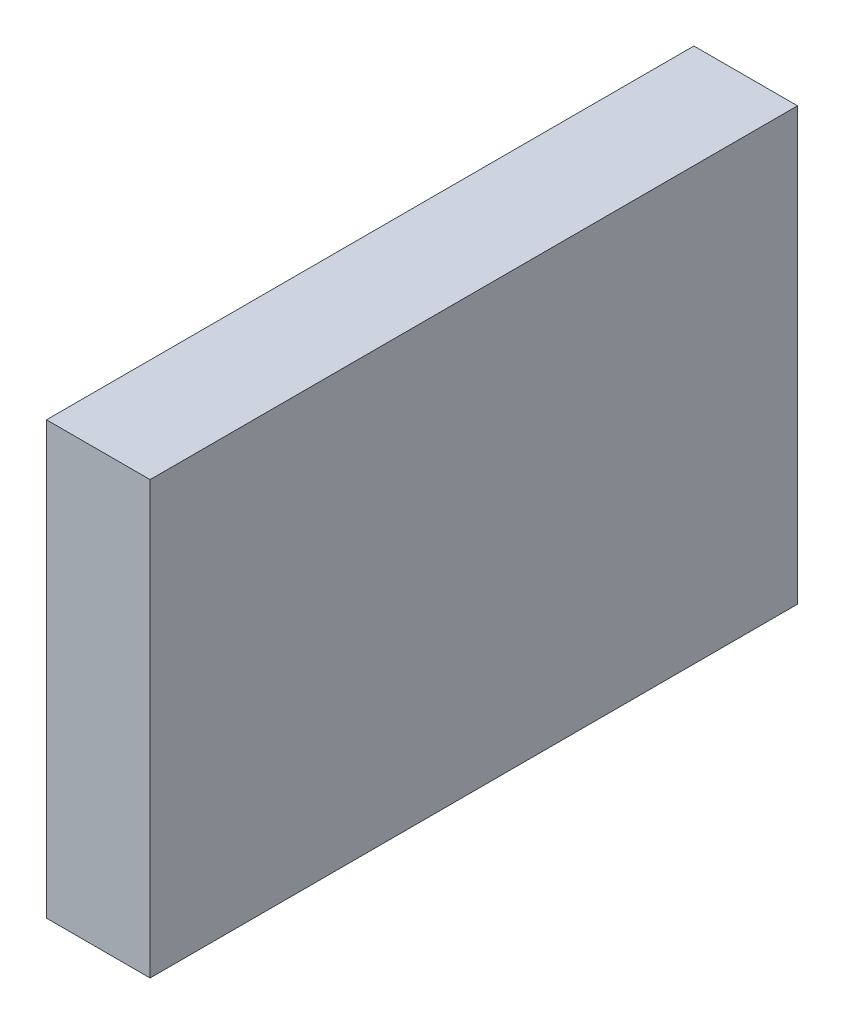
ISO-10303-21;
HEADER;
FILE_DESCRIPTION(('STEP AP214'),'2;1');
FILE_NAME('part.step','',(''),(''),'','','');
FILE_SCHEMA(('AUTOMOTIVE_DESIGN { 1 0 10303 214 1 1 1 1 }'));
ENDSEC;
DATA;
#1=APPLICATION_CONTEXT('core data for automotive mechanical design processes');
#2=APPLICATION_PROTOCOL_DEFINITION('international standard','automotive_design',2000,#1);
#3=PRODUCT_CONTEXT('',#1,'mechanical');
#4=PRODUCT('Part','Part','',(#3));
#5=PRODUCT_RELATED_PRODUCT_CATEGORY('part','',(#4));
#6=PRODUCT_DEFINITION_FORMATION('','',#4);
#7=PRODUCT_DEFINITION_CONTEXT('part definition',#1,'design');
#8=PRODUCT_DEFINITION('design','',#6,#7);
#9=PRODUCT_DEFINITION_SHAPE('','',#8);
#10=(LENGTH_UNIT() NAMED_UNIT(*) SI_UNIT(.MILLI.,.METRE.));
#11=(NAMED_UNIT(*) PLANE_ANGLE_UNIT() SI_UNIT($,.RADIAN.));
#12=(NAMED_UNIT(*) SI_UNIT($,.STERADIAN.) SOLID_ANGLE_UNIT());
#13=UNCERTAINTY_MEASURE_WITH_UNIT(LENGTH_MEASURE(1.E-05),#10,'distance_accuracy_value','');
#14=(GEOMETRIC_REPRESENTATION_CONTEXT(3) GLOBAL_UNCERTAINTY_ASSIGNED_CONTEXT((#13)) GLOBAL_UNIT_ASSIGNED_CONTEXT((#10,
#11,#12)) REPRESENTATION_CONTEXT('',''));
#15=CARTESIAN_POINT('',(0.,0.,0.));
#16=DIRECTION('',(0.,0.,1.));
#17=DIRECTION('',(1.,0.,0.));
#18=AXIS2_PLACEMENT_3D('',#15,#16,#17);
#19=CARTESIAN_POINT('',(12.7,25.4,38.1));
#20=DIRECTION('',(0.,0.,-1.));
#21=DIRECTION('',(-1.,0.,0.));
#22=AXIS2_PLACEMENT_3D('',#19,#20,#21);
#23=PLANE('',#22);
#24=DIRECTION('',(-1.,0.,0.));
#25=VECTOR('',#24,1.);
#26=CARTESIAN_POINT('',(12.7,25.4,38.1));
#27=LINE('',#26,#25);
#28=CARTESIAN_POINT('',(12.7,25.4,38.1));
#29=VERTEX_POINT('',#28);
#30=CARTESIAN_POINT('',(0.507999999999995,25.4,38.1));
#31=VERTEX_POINT('',#30);
#32=EDGE_CURVE('E152',#29,#31,#27,.T.);
#33=ORIENTED_EDGE('',*,*,#32,.T.);
#34=DIRECTION('',(0.,-1.,0.));
#35=VECTOR('',#34,1.);
#36=CARTESIAN_POINT('',(0.507999999999995,25.4,38.1));
#37=LINE('',#36,#35);
#38=CARTESIAN_POINT('',(0.507999999999995,-25.4,38.1));
#39=VERTEX_POINT('',#38);
#40=EDGE_CURVE('E11',#31,#39,#37,.T.);
#41=ORIENTED_EDGE('',*,*,#40,.T.);
#42=DIRECTION('',(-1.,0.,0.));
#43=VECTOR('',#42,1.);
#44=CARTESIAN_POINT('',(12.7,-25.4,38.1));
#45=LINE('',#44,#43);
#46=CARTESIAN_POINT('',(12.7,-25.4,38.1));
#47=VERTEX_POINT('',#46);
#48=EDGE_CURVE('E94',#47,#39,#45,.T.);
#49=ORIENTED_EDGE('',*,*,#48,.F.);
#50=DIRECTION('',(0.,-1.,0.));
#51=VECTOR('',#50,1.);
#52=CARTESIAN_POINT('',(12.7,25.4,38.1));
#53=LINE('',#52,#51);
#54=EDGE_CURVE('E100',#29,#47,#53,.T.);
#55=ORIENTED_EDGE('',*,*,#54,.F.);
#56=EDGE_LOOP('',(#33,#41,#49,#55));
#57=FACE_BOUND('',#56,.T.);
#58=ADVANCED_FACE('F33',(#57),#23,.F.);
#59=CARTESIAN_POINT('',(12.7,-25.4,38.1));
#60=DIRECTION('',(0.,1.,0.));
#61=DIRECTION('',(0.,0.,1.));
#62=AXIS2_PLACEMENT_3D('',#59,#60,#61);
#63=PLANE('',#62);
#64=ORIENTED_EDGE('',*,*,#48,.T.);
#65=DIRECTION('',(0.,0.,-1.));
#66=VECTOR('',#65,1.);
#67=CARTESIAN_POINT('',(0.507999999999995,-25.4,38.1));
#68=LINE('',#67,#66);
#69=CARTESIAN_POINT('',(0.507999999999995,-25.4,-38.1));
#70=VERTEX_POINT('',#69);
#71=EDGE_CURVE('E109',#39,#70,#68,.T.);
#72=ORIENTED_EDGE('',*,*,#71,.T.);
#73=DIRECTION('',(-1.,0.,0.));
#74=VECTOR('',#73,1.);
#75=CARTESIAN_POINT('',(12.7,-25.4,-38.1));
#76=LINE('',#75,#74);
#77=CARTESIAN_POINT('',(12.7,-25.4,-38.1));
#78=VERTEX_POINT('',#77);
#79=EDGE_CURVE('E96',#78,#70,#76,.T.);
#80=ORIENTED_EDGE('',*,*,#79,.F.);
#81=DIRECTION('',(0.,0.,-1.));
#82=VECTOR('',#81,1.);
#83=CARTESIAN_POINT('',(12.7,-25.4,38.1));
#84=LINE('',#83,#82);
#85=EDGE_CURVE('E89',#47,#78,#84,.T.);
#86=ORIENTED_EDGE('',*,*,#85,.F.);
#87=EDGE_LOOP('',(#64,#72,#80,#86));
#88=FACE_BOUND('',#87,.T.);
#89=ADVANCED_FACE('F91',(#88),#63,.F.);
#90=CARTESIAN_POINT('',(12.7,25.4,-38.1));
#91=DIRECTION('',(0.,0.,1.));
#92=DIRECTION('',(0.,-1.,0.));
#93=AXIS2_PLACEMENT_3D('',#90,#91,#92);
#94=PLANE('',#93);
#95=ORIENTED_EDGE('',*,*,#79,.T.);
#96=DIRECTION('',(0.,1.,0.));
#97=VECTOR('',#96,1.);
#98=CARTESIAN_POINT('',(0.507999999999995,25.4,-38.1));
#99=LINE('',#98,#97);
#100=CARTESIAN_POINT('',(0.507999999999995,25.4,-38.1));
#101=VERTEX_POINT('',#100);
#102=EDGE_CURVE('E57',#70,#101,#99,.T.);
#103=ORIENTED_EDGE('',*,*,#102,.T.);
#104=DIRECTION('',(-1.,0.,0.));
#105=VECTOR('',#104,1.);
#106=CARTESIAN_POINT('',(12.7,25.4,-38.1));
#107=LINE('',#106,#105);
#108=CARTESIAN_POINT('',(12.7,25.4,-38.1));
#109=VERTEX_POINT('',#108);
#110=EDGE_CURVE('E113',#109,#101,#107,.T.);
#111=ORIENTED_EDGE('',*,*,#110,.F.);
#112=DIRECTION('',(0.,1.,0.));
#113=VECTOR('',#112,1.);
#114=CARTESIAN_POINT('',(12.7,25.4,-38.1));
#115=LINE('',#114,#113);
#116=EDGE_CURVE('E99',#78,#109,#115,.T.);
#117=ORIENTED_EDGE('',*,*,#116,.F.);
#118=EDGE_LOOP('',(#95,#103,#111,#117));
#119=FACE_BOUND('',#118,.T.);
#120=ADVANCED_FACE('F150',(#119),#94,.F.);
#121=CARTESIAN_POINT('',(12.7,25.4,38.1));
#122=DIRECTION('',(0.,-1.,0.));
#123=DIRECTION('',(0.,0.,-1.));
#124=AXIS2_PLACEMENT_3D('',#121,#122,#123);
#125=PLANE('',#124);
#126=ORIENTED_EDGE('',*,*,#110,.T.);
#127=DIRECTION('',(0.,0.,1.));
#128=VECTOR('',#127,1.);
#129=CARTESIAN_POINT('',(0.507999999999995,25.4,38.1));
#130=LINE('',#129,#128);
#131=EDGE_CURVE('E42',#101,#31,#130,.T.);
#132=ORIENTED_EDGE('',*,*,#131,.T.);
#133=ORIENTED_EDGE('',*,*,#32,.F.);
#134=DIRECTION('',(0.,0.,1.));
#135=VECTOR('',#134,1.);
#136=CARTESIAN_POINT('',(12.7,25.4,38.1));
#137=LINE('',#136,#135);
#138=EDGE_CURVE('E105',#109,#29,#137,.T.);
#139=ORIENTED_EDGE('',*,*,#138,.F.);
#140=EDGE_LOOP('',(#126,#132,#133,#139));
#141=FACE_BOUND('',#140,.T.);
#142=ADVANCED_FACE('F155',(#141),#125,.F.);
#143=CARTESIAN_POINT('',(12.7,0.,0.));
#144=DIRECTION('',(1.,0.,0.));
#145=DIRECTION('',(0.,0.,-1.));
#146=AXIS2_PLACEMENT_3D('',#143,#144,#145);
#147=PLANE('',#146);
#148=ORIENTED_EDGE('',*,*,#54,.T.);
#149=ORIENTED_EDGE('',*,*,#85,.T.);
#150=ORIENTED_EDGE('',*,*,#116,.T.);
#151=ORIENTED_EDGE('',*,*,#138,.T.);
#152=EDGE_LOOP('',(#148,#149,#150,#151));
#153=FACE_BOUND('',#152,.T.);
#154=ADVANCED_FACE('F103',(#153),#147,.T.);
#155=CARTESIAN_POINT('',(0.,0.,0.));
#156=DIRECTION('',(1.,0.,0.));
#157=DIRECTION('',(0.,0.,-1.));
#158=AXIS2_PLACEMENT_3D('',#155,#156,#157);
#159=PLANE('',#158);
#160=DIRECTION('',(0.,-1.,0.));
#161=VECTOR('',#160,1.);
#162=CARTESIAN_POINT('',(0.,0.,-37.592));
#163=LINE('',#162,#161);
#164=CARTESIAN_POINT('',(0.,24.892,-37.592));
#165=VERTEX_POINT('',#164);
#166=CARTESIAN_POINT('',(0.,-24.892,-37.592));
#167=VERTEX_POINT('',#166);
#168=EDGE_CURVE('E120',#165,#167,#163,.T.);
#169=ORIENTED_EDGE('',*,*,#168,.T.);
#170=DIRECTION('',(0.,0.,1.));
#171=VECTOR('',#170,1.);
#172=CARTESIAN_POINT('',(0.,-24.892,0.));
#173=LINE('',#172,#171);
#174=CARTESIAN_POINT('',(0.,-24.892,37.592));
#175=VERTEX_POINT('',#174);
#176=EDGE_CURVE('E122',#167,#175,#173,.T.);
#177=ORIENTED_EDGE('',*,*,#176,.T.);
#178=DIRECTION('',(0.,1.,0.));
#179=VECTOR('',#178,1.);
#180=CARTESIAN_POINT('',(0.,0.,37.592));
#181=LINE('',#180,#179);
#182=CARTESIAN_POINT('',(0.,24.892,37.592));
#183=VERTEX_POINT('',#182);
#184=EDGE_CURVE('E111',#175,#183,#181,.T.);
#185=ORIENTED_EDGE('',*,*,#184,.T.);
#186=DIRECTION('',(0.,0.,-1.));
#187=VECTOR('',#186,1.);
#188=CARTESIAN_POINT('',(0.,24.892,0.));
#189=LINE('',#188,#187);
#190=EDGE_CURVE('E118',#183,#165,#189,.T.);
#191=ORIENTED_EDGE('',*,*,#190,.T.);
#192=EDGE_LOOP('',(#169,#177,#185,#191));
#193=FACE_BOUND('',#192,.T.);
#194=ADVANCED_FACE('F143',(#193),#159,.F.);
#195=CARTESIAN_POINT('',(0.507999999999995,25.4,38.1));
#196=DIRECTION('',(0.707106781186548,-0.707106781186548,0.));
#197=DIRECTION('',(0.,0.,1.));
#198=AXIS2_PLACEMENT_3D('',#195,#196,#197);
#199=PLANE('',#198);
#200=DIRECTION('',(-0.57735026918963,-0.57735026918963,0.577350269189618));
#201=VECTOR('',#200,1.);
#202=CARTESIAN_POINT('',(-24.8919999999998,1.76941794549634E-13,-12.7000000000007));
#203=LINE('',#202,#201);
#204=EDGE_CURVE('E130',#165,#101,#203,.F.);
#205=ORIENTED_EDGE('',*,*,#204,.F.);
#206=ORIENTED_EDGE('',*,*,#190,.F.);
#207=DIRECTION('',(-0.577350269189626,-0.577350269189626,-0.577350269189626));
#208=VECTOR('',#207,1.);
#209=CARTESIAN_POINT('',(0.507999999999995,25.4,38.1));
#210=LINE('',#209,#208);
#211=EDGE_CURVE('E37',#31,#183,#210,.T.);
#212=ORIENTED_EDGE('',*,*,#211,.F.);
#213=ORIENTED_EDGE('',*,*,#131,.F.);
#214=EDGE_LOOP('',(#205,#206,#212,#213));
#215=FACE_BOUND('',#214,.T.);
#216=ADVANCED_FACE('F35',(#215),#199,.F.);
#217=CARTESIAN_POINT('',(0.507999999999995,25.4,38.1));
#218=DIRECTION('',(0.707106781186548,0.,-0.707106781186548));
#219=DIRECTION('',(0.,-1.,0.));
#220=AXIS2_PLACEMENT_3D('',#217,#218,#219);
#221=PLANE('',#220);
#222=ORIENTED_EDGE('',*,*,#211,.T.);
#223=ORIENTED_EDGE('',*,*,#184,.F.);
#224=DIRECTION('',(0.577350269189626,-0.577350269189626,0.577350269189626));
#225=VECTOR('',#224,1.);
#226=CARTESIAN_POINT('',(-16.4253333333333,-8.46666666666665,21.1666666666667));
#227=LINE('',#226,#225);
#228=EDGE_CURVE('E129',#39,#175,#227,.F.);
#229=ORIENTED_EDGE('',*,*,#228,.F.);
#230=ORIENTED_EDGE('',*,*,#40,.F.);
#231=EDGE_LOOP('',(#222,#223,#229,#230));
#232=FACE_BOUND('',#231,.T.);
#233=ADVANCED_FACE('F139',(#232),#221,.F.);
#234=CARTESIAN_POINT('',(0.507999999999995,25.4,-38.1));
#235=DIRECTION('',(0.70710678118654,0.,0.707106781186555));
#236=DIRECTION('',(0.,1.,0.));
#237=AXIS2_PLACEMENT_3D('',#234,#235,#236);
#238=PLANE('',#237);
#239=ORIENTED_EDGE('',*,*,#204,.T.);
#240=ORIENTED_EDGE('',*,*,#102,.F.);
#241=DIRECTION('',(-0.57735026918963,0.57735026918963,0.577350269189618));
#242=VECTOR('',#241,1.);
#243=CARTESIAN_POINT('',(-16.4253333333336,-8.46666666666643,-21.1666666666668));
#244=LINE('',#243,#242);
#245=EDGE_CURVE('E127',#167,#70,#244,.F.);
#246=ORIENTED_EDGE('',*,*,#245,.F.);
#247=ORIENTED_EDGE('',*,*,#168,.F.);
#248=EDGE_LOOP('',(#239,#240,#246,#247));
#249=FACE_BOUND('',#248,.T.);
#250=ADVANCED_FACE('F149',(#249),#238,.F.);
#251=CARTESIAN_POINT('',(0.507999999999995,-25.4,38.1));
#252=DIRECTION('',(0.707106781186548,0.707106781186548,0.));
#253=DIRECTION('',(0.,0.,-1.));
#254=AXIS2_PLACEMENT_3D('',#251,#252,#253);
#255=PLANE('',#254);
#256=ORIENTED_EDGE('',*,*,#228,.T.);
#257=ORIENTED_EDGE('',*,*,#176,.F.);
#258=ORIENTED_EDGE('',*,*,#245,.T.);
#259=ORIENTED_EDGE('',*,*,#71,.F.);
#260=EDGE_LOOP('',(#256,#257,#258,#259));
#261=FACE_BOUND('',#260,.T.);
#262=ADVANCED_FACE('F147',(#261),#255,.F.);
#263=CLOSED_SHELL('',(#58,#89,#120,#142,#154,#194,#216,#233,#250,#262));
#264=MANIFOLD_SOLID_BREP('B2',#263);
#265=ADVANCED_BREP_SHAPE_REPRESENTATION('',(#18,#264),#14);
#266=SHAPE_DEFINITION_REPRESENTATION(#9,#265);
ENDSEC;
END-ISO-10303-21;
